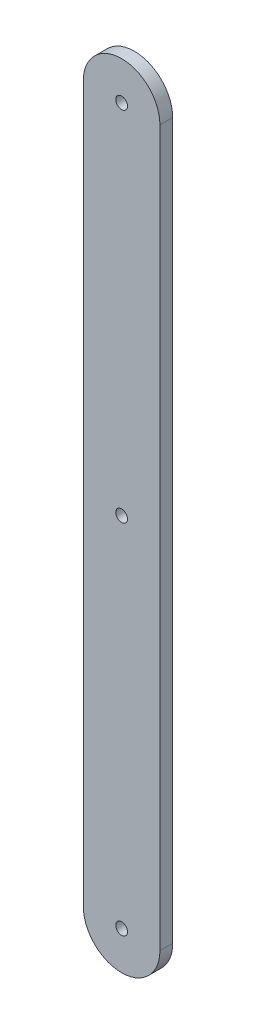
ISO-10303-21;
HEADER;
FILE_DESCRIPTION(('STEP AP214'),'2;1');
FILE_NAME('part.step','',(''),(''),'','','');
FILE_SCHEMA(('AUTOMOTIVE_DESIGN { 1 0 10303 214 1 1 1 1 }'));
ENDSEC;
DATA;
#1=APPLICATION_CONTEXT('core data for automotive mechanical design processes');
#2=APPLICATION_PROTOCOL_DEFINITION('international standard','automotive_design',2000,#1);
#3=PRODUCT_CONTEXT('',#1,'mechanical');
#4=PRODUCT('Part','Part','',(#3));
#5=PRODUCT_RELATED_PRODUCT_CATEGORY('part','',(#4));
#6=PRODUCT_DEFINITION_FORMATION('','',#4);
#7=PRODUCT_DEFINITION_CONTEXT('part definition',#1,'design');
#8=PRODUCT_DEFINITION('design','',#6,#7);
#9=PRODUCT_DEFINITION_SHAPE('','',#8);
#10=(LENGTH_UNIT() NAMED_UNIT(*) SI_UNIT(.MILLI.,.METRE.));
#11=(NAMED_UNIT(*) PLANE_ANGLE_UNIT() SI_UNIT($,.RADIAN.));
#12=(NAMED_UNIT(*) SI_UNIT($,.STERADIAN.) SOLID_ANGLE_UNIT());
#13=UNCERTAINTY_MEASURE_WITH_UNIT(LENGTH_MEASURE(1.E-05),#10,'distance_accuracy_value','');
#14=(GEOMETRIC_REPRESENTATION_CONTEXT(3) GLOBAL_UNCERTAINTY_ASSIGNED_CONTEXT((#13)) GLOBAL_UNIT_ASSIGNED_CONTEXT((#10,
#11,#12)) REPRESENTATION_CONTEXT('',''));
#15=CARTESIAN_POINT('',(0.,0.,0.));
#16=DIRECTION('',(0.,0.,1.));
#17=DIRECTION('',(1.,0.,0.));
#18=AXIS2_PLACEMENT_3D('',#15,#16,#17);
#19=CARTESIAN_POINT('',(-9.82801288749565,0.,3.175));
#20=DIRECTION('',(0.,0.,1.));
#21=DIRECTION('',(1.,0.,0.));
#22=AXIS2_PLACEMENT_3D('',#19,#20,#21);
#23=PLANE('',#22);
#24=CARTESIAN_POINT('',(-9.82801288749566,88.9,3.175));
#25=DIRECTION('',(0.,0.,-1.));
#26=DIRECTION('',(-1.,0.,0.));
#27=AXIS2_PLACEMENT_3D('',#24,#25,#26);
#28=CIRCLE('',#27,1.4605);
#29=CARTESIAN_POINT('',(-11.2885128874957,88.9,3.175));
#30=VERTEX_POINT('',#29);
#31=EDGE_CURVE('E121',#30,#30,#28,.T.);
#32=ORIENTED_EDGE('',*,*,#31,.T.);
#33=EDGE_LOOP('',(#32));
#34=FACE_BOUND('',#33,.T.);
#35=CARTESIAN_POINT('',(-9.82801288749568,177.8,3.175));
#36=DIRECTION('',(0.,0.,1.));
#37=DIRECTION('',(1.,0.,0.));
#38=AXIS2_PLACEMENT_3D('',#35,#36,#37);
#39=CIRCLE('',#38,1.4605);
#40=CARTESIAN_POINT('',(-8.36751288749568,177.8,3.175));
#41=VERTEX_POINT('',#40);
#42=EDGE_CURVE('E100',#41,#41,#39,.T.);
#43=ORIENTED_EDGE('',*,*,#42,.F.);
#44=EDGE_LOOP('',(#43));
#45=FACE_BOUND('',#44,.T.);
#46=CARTESIAN_POINT('',(-9.82801288749565,0.,3.175));
#47=DIRECTION('',(0.,0.,1.));
#48=DIRECTION('',(1.,0.,0.));
#49=AXIS2_PLACEMENT_3D('',#46,#47,#48);
#50=CIRCLE('',#49,9.52499999999999);
#51=CARTESIAN_POINT('',(-19.3530128874956,0.,3.175));
#52=VERTEX_POINT('',#51);
#53=CARTESIAN_POINT('',(-0.30301288749566,0.,3.175));
#54=VERTEX_POINT('',#53);
#55=EDGE_CURVE('E85',#52,#54,#50,.T.);
#56=ORIENTED_EDGE('',*,*,#55,.T.);
#57=DIRECTION('',(0.,1.,0.));
#58=VECTOR('',#57,1.);
#59=CARTESIAN_POINT('',(-0.303012887495681,177.8,3.175));
#60=LINE('',#59,#58);
#61=CARTESIAN_POINT('',(-0.303012887495681,177.8,3.175));
#62=VERTEX_POINT('',#61);
#63=EDGE_CURVE('E80',#54,#62,#60,.T.);
#64=ORIENTED_EDGE('',*,*,#63,.T.);
#65=CARTESIAN_POINT('',(-9.82801288749568,177.8,3.175));
#66=DIRECTION('',(0.,0.,1.));
#67=DIRECTION('',(-1.,0.,0.));
#68=AXIS2_PLACEMENT_3D('',#65,#66,#67);
#69=CIRCLE('',#68,9.525);
#70=CARTESIAN_POINT('',(-19.3530128874957,177.8,3.175));
#71=VERTEX_POINT('',#70);
#72=EDGE_CURVE('E83',#62,#71,#69,.T.);
#73=ORIENTED_EDGE('',*,*,#72,.T.);
#74=DIRECTION('',(0.,-1.,0.));
#75=VECTOR('',#74,1.);
#76=CARTESIAN_POINT('',(-19.3530128874956,0.,3.175));
#77=LINE('',#76,#75);
#78=EDGE_CURVE('E50',#71,#52,#77,.T.);
#79=ORIENTED_EDGE('',*,*,#78,.T.);
#80=EDGE_LOOP('',(#56,#64,#73,#79));
#81=FACE_BOUND('',#80,.T.);
#82=CARTESIAN_POINT('',(-9.82801288749565,0.,3.175));
#83=DIRECTION('',(0.,0.,1.));
#84=DIRECTION('',(1.,0.,0.));
#85=AXIS2_PLACEMENT_3D('',#82,#83,#84);
#86=CIRCLE('',#85,1.4605);
#87=CARTESIAN_POINT('',(-8.36751288749565,0.,3.175));
#88=VERTEX_POINT('',#87);
#89=EDGE_CURVE('E115',#88,#88,#86,.T.);
#90=ORIENTED_EDGE('',*,*,#89,.F.);
#91=EDGE_LOOP('',(#90));
#92=FACE_BOUND('',#91,.T.);
#93=ADVANCED_FACE('F33',(#34,#45,#81,#92),#23,.T.);
#94=CARTESIAN_POINT('',(-9.82801288749565,0.,0.));
#95=DIRECTION('',(0.,0.,1.));
#96=DIRECTION('',(1.,0.,0.));
#97=AXIS2_PLACEMENT_3D('',#94,#95,#96);
#98=PLANE('',#97);
#99=CARTESIAN_POINT('',(-9.82801288749566,88.9,0.));
#100=DIRECTION('',(0.,0.,-1.));
#101=DIRECTION('',(-1.,0.,0.));
#102=AXIS2_PLACEMENT_3D('',#99,#100,#101);
#103=CIRCLE('',#102,1.4605);
#104=CARTESIAN_POINT('',(-11.2885128874957,88.9,0.));
#105=VERTEX_POINT('',#104);
#106=EDGE_CURVE('E124',#105,#105,#103,.T.);
#107=ORIENTED_EDGE('',*,*,#106,.F.);
#108=EDGE_LOOP('',(#107));
#109=FACE_BOUND('',#108,.T.);
#110=CARTESIAN_POINT('',(-9.82801288749565,0.,0.));
#111=DIRECTION('',(0.,0.,1.));
#112=DIRECTION('',(1.,0.,0.));
#113=AXIS2_PLACEMENT_3D('',#110,#111,#112);
#114=CIRCLE('',#113,9.52499999999999);
#115=CARTESIAN_POINT('',(-19.3530128874956,0.,0.));
#116=VERTEX_POINT('',#115);
#117=CARTESIAN_POINT('',(-0.30301288749566,0.,0.));
#118=VERTEX_POINT('',#117);
#119=EDGE_CURVE('E97',#116,#118,#114,.T.);
#120=ORIENTED_EDGE('',*,*,#119,.F.);
#121=DIRECTION('',(0.,-1.,0.));
#122=VECTOR('',#121,1.);
#123=CARTESIAN_POINT('',(-19.3530128874956,0.,0.));
#124=LINE('',#123,#122);
#125=CARTESIAN_POINT('',(-19.3530128874957,177.8,0.));
#126=VERTEX_POINT('',#125);
#127=EDGE_CURVE('E73',#126,#116,#124,.T.);
#128=ORIENTED_EDGE('',*,*,#127,.F.);
#129=CARTESIAN_POINT('',(-9.82801288749568,177.8,0.));
#130=DIRECTION('',(0.,0.,1.));
#131=DIRECTION('',(-1.,0.,0.));
#132=AXIS2_PLACEMENT_3D('',#129,#130,#131);
#133=CIRCLE('',#132,9.525);
#134=CARTESIAN_POINT('',(-0.303012887495681,177.8,0.));
#135=VERTEX_POINT('',#134);
#136=EDGE_CURVE('E67',#135,#126,#133,.T.);
#137=ORIENTED_EDGE('',*,*,#136,.F.);
#138=DIRECTION('',(0.,1.,0.));
#139=VECTOR('',#138,1.);
#140=CARTESIAN_POINT('',(-0.303012887495681,177.8,0.));
#141=LINE('',#140,#139);
#142=EDGE_CURVE('E89',#118,#135,#141,.T.);
#143=ORIENTED_EDGE('',*,*,#142,.F.);
#144=EDGE_LOOP('',(#120,#128,#137,#143));
#145=FACE_BOUND('',#144,.T.);
#146=CARTESIAN_POINT('',(-9.82801288749568,177.8,0.));
#147=DIRECTION('',(0.,0.,1.));
#148=DIRECTION('',(1.,0.,0.));
#149=AXIS2_PLACEMENT_3D('',#146,#147,#148);
#150=CIRCLE('',#149,1.4605);
#151=CARTESIAN_POINT('',(-8.36751288749568,177.8,0.));
#152=VERTEX_POINT('',#151);
#153=EDGE_CURVE('E112',#152,#152,#150,.T.);
#154=ORIENTED_EDGE('',*,*,#153,.T.);
#155=EDGE_LOOP('',(#154));
#156=FACE_BOUND('',#155,.T.);
#157=CARTESIAN_POINT('',(-9.82801288749565,0.,0.));
#158=DIRECTION('',(0.,0.,1.));
#159=DIRECTION('',(1.,0.,0.));
#160=AXIS2_PLACEMENT_3D('',#157,#158,#159);
#161=CIRCLE('',#160,1.4605);
#162=CARTESIAN_POINT('',(-8.36751288749565,0.,0.));
#163=VERTEX_POINT('',#162);
#164=EDGE_CURVE('E118',#163,#163,#161,.T.);
#165=ORIENTED_EDGE('',*,*,#164,.T.);
#166=EDGE_LOOP('',(#165));
#167=FACE_BOUND('',#166,.T.);
#168=ADVANCED_FACE('F108',(#109,#145,#156,#167),#98,.F.);
#169=CARTESIAN_POINT('',(-9.82801288749565,0.,3.175));
#170=DIRECTION('',(0.,0.,-1.));
#171=DIRECTION('',(-1.,0.,0.));
#172=AXIS2_PLACEMENT_3D('',#169,#170,#171);
#173=CYLINDRICAL_SURFACE('',#172,9.52499999999999);
#174=ORIENTED_EDGE('',*,*,#119,.T.);
#175=DIRECTION('',(0.,0.,-1.));
#176=VECTOR('',#175,1.);
#177=CARTESIAN_POINT('',(-0.30301288749566,0.,3.175));
#178=LINE('',#177,#176);
#179=EDGE_CURVE('E11',#54,#118,#178,.T.);
#180=ORIENTED_EDGE('',*,*,#179,.F.);
#181=ORIENTED_EDGE('',*,*,#55,.F.);
#182=DIRECTION('',(0.,0.,-1.));
#183=VECTOR('',#182,1.);
#184=CARTESIAN_POINT('',(-19.3530128874956,0.,3.175));
#185=LINE('',#184,#183);
#186=EDGE_CURVE('E93',#52,#116,#185,.T.);
#187=ORIENTED_EDGE('',*,*,#186,.T.);
#188=EDGE_LOOP('',(#174,#180,#181,#187));
#189=FACE_BOUND('',#188,.T.);
#190=ADVANCED_FACE('F35',(#189),#173,.T.);
#191=CARTESIAN_POINT('',(-0.303012887495681,177.8,3.175));
#192=DIRECTION('',(-1.,0.,0.));
#193=DIRECTION('',(0.,-1.,0.));
#194=AXIS2_PLACEMENT_3D('',#191,#192,#193);
#195=PLANE('',#194);
#196=ORIENTED_EDGE('',*,*,#142,.T.);
#197=DIRECTION('',(0.,0.,-1.));
#198=VECTOR('',#197,1.);
#199=CARTESIAN_POINT('',(-0.303012887495681,177.8,3.175));
#200=LINE('',#199,#198);
#201=EDGE_CURVE('E42',#62,#135,#200,.T.);
#202=ORIENTED_EDGE('',*,*,#201,.F.);
#203=ORIENTED_EDGE('',*,*,#63,.F.);
#204=ORIENTED_EDGE('',*,*,#179,.T.);
#205=EDGE_LOOP('',(#196,#202,#203,#204));
#206=FACE_BOUND('',#205,.T.);
#207=ADVANCED_FACE('F88',(#206),#195,.F.);
#208=CARTESIAN_POINT('',(-9.82801288749568,177.8,3.175));
#209=DIRECTION('',(0.,0.,-1.));
#210=DIRECTION('',(-1.,0.,0.));
#211=AXIS2_PLACEMENT_3D('',#208,#209,#210);
#212=CYLINDRICAL_SURFACE('',#211,9.525);
#213=ORIENTED_EDGE('',*,*,#136,.T.);
#214=DIRECTION('',(0.,0.,-1.));
#215=VECTOR('',#214,1.);
#216=CARTESIAN_POINT('',(-19.3530128874957,177.8,3.175));
#217=LINE('',#216,#215);
#218=EDGE_CURVE('E90',#71,#126,#217,.T.);
#219=ORIENTED_EDGE('',*,*,#218,.F.);
#220=ORIENTED_EDGE('',*,*,#72,.F.);
#221=ORIENTED_EDGE('',*,*,#201,.T.);
#222=EDGE_LOOP('',(#213,#219,#220,#221));
#223=FACE_BOUND('',#222,.T.);
#224=ADVANCED_FACE('F91',(#223),#212,.T.);
#225=CARTESIAN_POINT('',(-19.3530128874956,0.,3.175));
#226=DIRECTION('',(1.,0.,0.));
#227=DIRECTION('',(0.,1.,0.));
#228=AXIS2_PLACEMENT_3D('',#225,#226,#227);
#229=PLANE('',#228);
#230=ORIENTED_EDGE('',*,*,#127,.T.);
#231=ORIENTED_EDGE('',*,*,#186,.F.);
#232=ORIENTED_EDGE('',*,*,#78,.F.);
#233=ORIENTED_EDGE('',*,*,#218,.T.);
#234=EDGE_LOOP('',(#230,#231,#232,#233));
#235=FACE_BOUND('',#234,.T.);
#236=ADVANCED_FACE('F105',(#235),#229,.F.);
#237=CARTESIAN_POINT('',(-9.82801288749568,177.8,3.175));
#238=DIRECTION('',(0.,0.,-1.));
#239=DIRECTION('',(-1.,0.,0.));
#240=AXIS2_PLACEMENT_3D('',#237,#238,#239);
#241=CYLINDRICAL_SURFACE('',#240,1.4605);
#242=ORIENTED_EDGE('',*,*,#42,.T.);
#243=EDGE_LOOP('',(#242));
#244=FACE_BOUND('',#243,.T.);
#245=ORIENTED_EDGE('',*,*,#153,.F.);
#246=EDGE_LOOP('',(#245));
#247=FACE_BOUND('',#246,.T.);
#248=ADVANCED_FACE('F150',(#244,#247),#241,.F.);
#249=CARTESIAN_POINT('',(-9.82801288749565,0.,3.175));
#250=DIRECTION('',(0.,0.,-1.));
#251=DIRECTION('',(-1.,0.,0.));
#252=AXIS2_PLACEMENT_3D('',#249,#250,#251);
#253=CYLINDRICAL_SURFACE('',#252,1.4605);
#254=ORIENTED_EDGE('',*,*,#89,.T.);
#255=EDGE_LOOP('',(#254));
#256=FACE_BOUND('',#255,.T.);
#257=ORIENTED_EDGE('',*,*,#164,.F.);
#258=EDGE_LOOP('',(#257));
#259=FACE_BOUND('',#258,.T.);
#260=ADVANCED_FACE('F135',(#256,#259),#253,.F.);
#261=CARTESIAN_POINT('',(-9.82801288749566,88.9,3.175));
#262=DIRECTION('',(0.,0.,-1.));
#263=DIRECTION('',(-1.,0.,0.));
#264=AXIS2_PLACEMENT_3D('',#261,#262,#263);
#265=CYLINDRICAL_SURFACE('',#264,1.4605);
#266=ORIENTED_EDGE('',*,*,#31,.F.);
#267=EDGE_LOOP('',(#266));
#268=FACE_BOUND('',#267,.T.);
#269=ORIENTED_EDGE('',*,*,#106,.T.);
#270=EDGE_LOOP('',(#269));
#271=FACE_BOUND('',#270,.T.);
#272=ADVANCED_FACE('F132',(#268,#271),#265,.F.);
#273=CLOSED_SHELL('',(#93,#168,#190,#207,#224,#236,#248,#260,#272));
#274=MANIFOLD_SOLID_BREP('B2',#273);
#275=ADVANCED_BREP_SHAPE_REPRESENTATION('',(#18,#274),#14);
#276=SHAPE_DEFINITION_REPRESENTATION(#9,#275);
ENDSEC;
END-ISO-10303-21;
